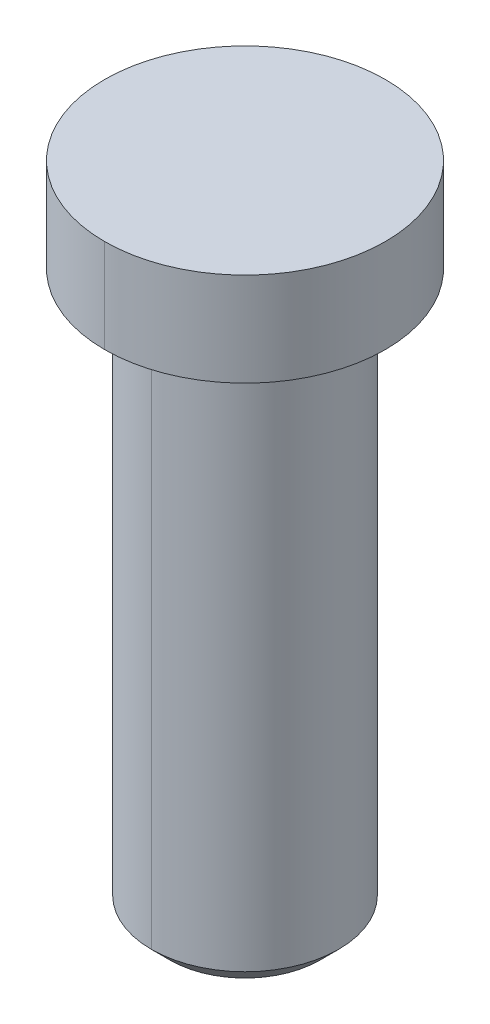
ISO-10303-21;
HEADER;
FILE_DESCRIPTION(('STEP AP214'),'2;1');
FILE_NAME('part.step','',(''),(''),'','','');
FILE_SCHEMA(('AUTOMOTIVE_DESIGN { 1 0 10303 214 1 1 1 1 }'));
ENDSEC;
DATA;
#1=APPLICATION_CONTEXT('core data for automotive mechanical design processes');
#2=APPLICATION_PROTOCOL_DEFINITION('international standard','automotive_design',2000,#1);
#3=PRODUCT_CONTEXT('',#1,'mechanical');
#4=PRODUCT('Part','Part','',(#3));
#5=PRODUCT_RELATED_PRODUCT_CATEGORY('part','',(#4));
#6=PRODUCT_DEFINITION_FORMATION('','',#4);
#7=PRODUCT_DEFINITION_CONTEXT('part definition',#1,'design');
#8=PRODUCT_DEFINITION('design','',#6,#7);
#9=PRODUCT_DEFINITION_SHAPE('','',#8);
#10=(LENGTH_UNIT() NAMED_UNIT(*) SI_UNIT(.MILLI.,.METRE.));
#11=(NAMED_UNIT(*) PLANE_ANGLE_UNIT() SI_UNIT($,.RADIAN.));
#12=(NAMED_UNIT(*) SI_UNIT($,.STERADIAN.) SOLID_ANGLE_UNIT());
#13=UNCERTAINTY_MEASURE_WITH_UNIT(LENGTH_MEASURE(1.E-05),#10,'distance_accuracy_value','');
#14=(GEOMETRIC_REPRESENTATION_CONTEXT(3) GLOBAL_UNCERTAINTY_ASSIGNED_CONTEXT((#13)) GLOBAL_UNIT_ASSIGNED_CONTEXT((#10,
#11,#12)) REPRESENTATION_CONTEXT('',''));
#15=CARTESIAN_POINT('',(0.,0.,0.));
#16=DIRECTION('',(0.,0.,1.));
#17=DIRECTION('',(1.,0.,0.));
#18=AXIS2_PLACEMENT_3D('',#15,#16,#17);
#19=CARTESIAN_POINT('',(0.,-7.,0.));
#20=DIRECTION('',(0.,-1.,0.));
#21=DIRECTION('',(0.,0.,-1.));
#22=AXIS2_PLACEMENT_3D('',#19,#20,#21);
#23=PLANE('',#22);
#24=CARTESIAN_POINT('',(0.,-7.,0.));
#25=DIRECTION('',(0.,-1.,0.));
#26=DIRECTION('',(0.,0.,-1.));
#27=AXIS2_PLACEMENT_3D('',#24,#25,#26);
#28=CIRCLE('',#27,0.800000000000001);
#29=CARTESIAN_POINT('',(0.,-7.,0.800000000000001));
#30=VERTEX_POINT('',#29);
#31=CARTESIAN_POINT('',(0.,-7.,-0.800000000000001));
#32=VERTEX_POINT('',#31);
#33=EDGE_CURVE('E117',#30,#32,#28,.T.);
#34=ORIENTED_EDGE('',*,*,#33,.T.);
#35=CARTESIAN_POINT('',(0.,-7.,0.));
#36=DIRECTION('',(0.,-1.,0.));
#37=DIRECTION('',(0.,0.,-1.));
#38=AXIS2_PLACEMENT_3D('',#35,#36,#37);
#39=CIRCLE('',#38,0.800000000000001);
#40=EDGE_CURVE('E151',#32,#30,#39,.T.);
#41=ORIENTED_EDGE('',*,*,#40,.T.);
#42=EDGE_LOOP('',(#34,#41));
#43=FACE_BOUND('',#42,.T.);
#44=ADVANCED_FACE('F45',(#43),#23,.T.);
#45=CARTESIAN_POINT('',(0.,-7.,0.));
#46=DIRECTION('',(0.,1.,0.));
#47=DIRECTION('',(0.,0.,1.));
#48=AXIS2_PLACEMENT_3D('',#45,#46,#47);
#49=CYLINDRICAL_SURFACE('',#48,1.);
#50=DIRECTION('',(0.,1.,0.));
#51=VECTOR('',#50,1.);
#52=CARTESIAN_POINT('',(0.,-7.,-1.));
#53=LINE('',#52,#51);
#54=CARTESIAN_POINT('',(0.,-6.8,-1.));
#55=VERTEX_POINT('',#54);
#56=CARTESIAN_POINT('',(0.,-1.,-1.));
#57=VERTEX_POINT('',#56);
#58=EDGE_CURVE('E121',#55,#57,#53,.T.);
#59=ORIENTED_EDGE('',*,*,#58,.F.);
#60=CARTESIAN_POINT('',(0.,-6.8,0.));
#61=DIRECTION('',(0.,-1.,0.));
#62=DIRECTION('',(0.,0.,-1.));
#63=AXIS2_PLACEMENT_3D('',#60,#61,#62);
#64=CIRCLE('',#63,1.);
#65=CARTESIAN_POINT('',(0.,-6.8,1.));
#66=VERTEX_POINT('',#65);
#67=EDGE_CURVE('E11',#55,#66,#64,.F.);
#68=ORIENTED_EDGE('',*,*,#67,.T.);
#69=DIRECTION('',(0.,1.,0.));
#70=VECTOR('',#69,1.);
#71=CARTESIAN_POINT('',(0.,-7.,1.));
#72=LINE('',#71,#70);
#73=CARTESIAN_POINT('',(0.,-1.,1.));
#74=VERTEX_POINT('',#73);
#75=EDGE_CURVE('E101',#66,#74,#72,.T.);
#76=ORIENTED_EDGE('',*,*,#75,.T.);
#77=CARTESIAN_POINT('',(0.,-1.,0.));
#78=DIRECTION('',(0.,-1.,0.));
#79=DIRECTION('',(0.,0.,-1.));
#80=AXIS2_PLACEMENT_3D('',#77,#78,#79);
#81=CIRCLE('',#80,1.);
#82=EDGE_CURVE('E104',#74,#57,#81,.T.);
#83=ORIENTED_EDGE('',*,*,#82,.T.);
#84=EDGE_LOOP('',(#59,#68,#76,#83));
#85=FACE_BOUND('',#84,.T.);
#86=ADVANCED_FACE('F103',(#85),#49,.T.);
#87=CARTESIAN_POINT('',(0.,0.,0.));
#88=DIRECTION('',(0.,1.,0.));
#89=DIRECTION('',(1.,0.,0.));
#90=AXIS2_PLACEMENT_3D('',#87,#88,#89);
#91=PLANE('',#90);
#92=CARTESIAN_POINT('',(0.,0.,0.));
#93=DIRECTION('',(0.,1.,0.));
#94=DIRECTION('',(0.,0.,1.));
#95=AXIS2_PLACEMENT_3D('',#92,#93,#94);
#96=CIRCLE('',#95,1.5);
#97=CARTESIAN_POINT('',(0.,0.,1.5));
#98=VERTEX_POINT('',#97);
#99=CARTESIAN_POINT('',(0.,0.,-1.5));
#100=VERTEX_POINT('',#99);
#101=EDGE_CURVE('E131',#98,#100,#96,.T.);
#102=ORIENTED_EDGE('',*,*,#101,.T.);
#103=CARTESIAN_POINT('',(0.,0.,0.));
#104=DIRECTION('',(0.,1.,0.));
#105=DIRECTION('',(0.,0.,1.));
#106=AXIS2_PLACEMENT_3D('',#103,#104,#105);
#107=CIRCLE('',#106,1.5);
#108=EDGE_CURVE('E118',#100,#98,#107,.T.);
#109=ORIENTED_EDGE('',*,*,#108,.T.);
#110=EDGE_LOOP('',(#102,#109));
#111=FACE_BOUND('',#110,.T.);
#112=ADVANCED_FACE('F166',(#111),#91,.T.);
#113=CARTESIAN_POINT('',(0.,-1.,0.));
#114=DIRECTION('',(0.,1.,0.));
#115=DIRECTION('',(1.,0.,0.));
#116=AXIS2_PLACEMENT_3D('',#113,#114,#115);
#117=PLANE('',#116);
#118=ORIENTED_EDGE('',*,*,#82,.F.);
#119=CARTESIAN_POINT('',(0.,-1.,0.));
#120=DIRECTION('',(0.,-1.,0.));
#121=DIRECTION('',(0.,0.,-1.));
#122=AXIS2_PLACEMENT_3D('',#119,#120,#121);
#123=CIRCLE('',#122,1.);
#124=EDGE_CURVE('E111',#57,#74,#123,.T.);
#125=ORIENTED_EDGE('',*,*,#124,.F.);
#126=EDGE_LOOP('',(#118,#125));
#127=FACE_BOUND('',#126,.T.);
#128=CARTESIAN_POINT('',(0.,-1.,0.));
#129=DIRECTION('',(0.,1.,0.));
#130=DIRECTION('',(0.,0.,1.));
#131=AXIS2_PLACEMENT_3D('',#128,#129,#130);
#132=CIRCLE('',#131,1.5);
#133=CARTESIAN_POINT('',(0.,-1.,1.5));
#134=VERTEX_POINT('',#133);
#135=CARTESIAN_POINT('',(0.,-1.,-1.5));
#136=VERTEX_POINT('',#135);
#137=EDGE_CURVE('E110',#134,#136,#132,.T.);
#138=ORIENTED_EDGE('',*,*,#137,.F.);
#139=CARTESIAN_POINT('',(0.,-1.,0.));
#140=DIRECTION('',(0.,1.,0.));
#141=DIRECTION('',(0.,0.,1.));
#142=AXIS2_PLACEMENT_3D('',#139,#140,#141);
#143=CIRCLE('',#142,1.5);
#144=EDGE_CURVE('E142',#136,#134,#143,.T.);
#145=ORIENTED_EDGE('',*,*,#144,.F.);
#146=EDGE_LOOP('',(#138,#145));
#147=FACE_BOUND('',#146,.T.);
#148=ADVANCED_FACE('F114',(#127,#147),#117,.F.);
#149=CARTESIAN_POINT('',(0.,-1.,0.));
#150=DIRECTION('',(0.,1.,0.));
#151=DIRECTION('',(0.,0.,1.));
#152=AXIS2_PLACEMENT_3D('',#149,#150,#151);
#153=CYLINDRICAL_SURFACE('',#152,1.5);
#154=DIRECTION('',(0.,1.,0.));
#155=VECTOR('',#154,1.);
#156=CARTESIAN_POINT('',(0.,-1.,-1.5));
#157=LINE('',#156,#155);
#158=EDGE_CURVE('E135',#136,#100,#157,.T.);
#159=ORIENTED_EDGE('',*,*,#158,.F.);
#160=ORIENTED_EDGE('',*,*,#144,.T.);
#161=DIRECTION('',(0.,1.,0.));
#162=VECTOR('',#161,1.);
#163=CARTESIAN_POINT('',(0.,-1.,1.5));
#164=LINE('',#163,#162);
#165=EDGE_CURVE('E134',#134,#98,#164,.T.);
#166=ORIENTED_EDGE('',*,*,#165,.T.);
#167=ORIENTED_EDGE('',*,*,#108,.F.);
#168=EDGE_LOOP('',(#159,#160,#166,#167));
#169=FACE_BOUND('',#168,.T.);
#170=ADVANCED_FACE('F170',(#169),#153,.T.);
#171=CARTESIAN_POINT('',(0.,-1.,0.));
#172=DIRECTION('',(0.,1.,0.));
#173=DIRECTION('',(0.,0.,1.));
#174=AXIS2_PLACEMENT_3D('',#171,#172,#173);
#175=CYLINDRICAL_SURFACE('',#174,1.5);
#176=ORIENTED_EDGE('',*,*,#137,.T.);
#177=ORIENTED_EDGE('',*,*,#158,.T.);
#178=ORIENTED_EDGE('',*,*,#101,.F.);
#179=ORIENTED_EDGE('',*,*,#165,.F.);
#180=EDGE_LOOP('',(#176,#177,#178,#179));
#181=FACE_BOUND('',#180,.T.);
#182=ADVANCED_FACE('F174',(#181),#175,.T.);
#183=CARTESIAN_POINT('',(0.,-7.,0.));
#184=DIRECTION('',(0.,1.,0.));
#185=DIRECTION('',(0.,0.,1.));
#186=AXIS2_PLACEMENT_3D('',#183,#184,#185);
#187=CYLINDRICAL_SURFACE('',#186,1.);
#188=ORIENTED_EDGE('',*,*,#75,.F.);
#189=CARTESIAN_POINT('',(0.,-6.8,0.));
#190=DIRECTION('',(0.,-1.,0.));
#191=DIRECTION('',(0.,0.,-1.));
#192=AXIS2_PLACEMENT_3D('',#189,#190,#191);
#193=CIRCLE('',#192,1.);
#194=EDGE_CURVE('E55',#66,#55,#193,.F.);
#195=ORIENTED_EDGE('',*,*,#194,.T.);
#196=ORIENTED_EDGE('',*,*,#58,.T.);
#197=ORIENTED_EDGE('',*,*,#124,.T.);
#198=EDGE_LOOP('',(#188,#195,#196,#197));
#199=FACE_BOUND('',#198,.T.);
#200=ADVANCED_FACE('F120',(#199),#187,.T.);
#201=CARTESIAN_POINT('',(0.,-7.,0.));
#202=DIRECTION('',(0.,1.,0.));
#203=DIRECTION('',(0.,0.,1.));
#204=AXIS2_PLACEMENT_3D('',#201,#202,#203);
#205=CONICAL_SURFACE('',#204,0.800000000000001,0.785398163397448);
#206=DIRECTION('',(0.,-0.707106781186548,-0.707106781186548));
#207=VECTOR('',#206,1.);
#208=CARTESIAN_POINT('',(0.,-6.8,1.));
#209=LINE('',#208,#207);
#210=EDGE_CURVE('E154',#66,#30,#209,.T.);
#211=ORIENTED_EDGE('',*,*,#210,.F.);
#212=ORIENTED_EDGE('',*,*,#67,.F.);
#213=DIRECTION('',(0.,0.707106781186548,-0.707106781186548));
#214=VECTOR('',#213,1.);
#215=CARTESIAN_POINT('',(0.,-7.,-0.800000000000001));
#216=LINE('',#215,#214);
#217=EDGE_CURVE('E50',#32,#55,#216,.T.);
#218=ORIENTED_EDGE('',*,*,#217,.F.);
#219=ORIENTED_EDGE('',*,*,#33,.F.);
#220=EDGE_LOOP('',(#211,#212,#218,#219));
#221=FACE_BOUND('',#220,.T.);
#222=ADVANCED_FACE('F48',(#221),#205,.T.);
#223=CARTESIAN_POINT('',(0.,-7.,0.));
#224=DIRECTION('',(0.,1.,0.));
#225=DIRECTION('',(0.,0.,1.));
#226=AXIS2_PLACEMENT_3D('',#223,#224,#225);
#227=CONICAL_SURFACE('',#226,0.800000000000001,0.785398163397448);
#228=ORIENTED_EDGE('',*,*,#217,.T.);
#229=ORIENTED_EDGE('',*,*,#194,.F.);
#230=ORIENTED_EDGE('',*,*,#210,.T.);
#231=ORIENTED_EDGE('',*,*,#40,.F.);
#232=EDGE_LOOP('',(#228,#229,#230,#231));
#233=FACE_BOUND('',#232,.T.);
#234=ADVANCED_FACE('F157',(#233),#227,.T.);
#235=CLOSED_SHELL('',(#44,#86,#112,#148,#170,#182,#200,#222,#234));
#236=MANIFOLD_SOLID_BREP('B2',#235);
#237=ADVANCED_BREP_SHAPE_REPRESENTATION('',(#18,#236),#14);
#238=SHAPE_DEFINITION_REPRESENTATION(#9,#237);
ENDSEC;
END-ISO-10303-21;
